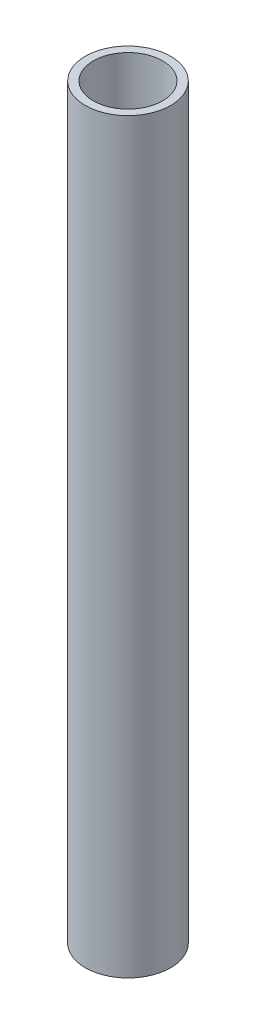
ISO-10303-21;
HEADER;
FILE_DESCRIPTION(('STEP AP214'),'2;1');
FILE_NAME('part.step','',(''),(''),'','','');
FILE_SCHEMA(('AUTOMOTIVE_DESIGN { 1 0 10303 214 1 1 1 1 }'));
ENDSEC;
DATA;
#1=APPLICATION_CONTEXT('core data for automotive mechanical design processes');
#2=APPLICATION_PROTOCOL_DEFINITION('international standard','automotive_design',2000,#1);
#3=PRODUCT_CONTEXT('',#1,'mechanical');
#4=PRODUCT('Part','Part','',(#3));
#5=PRODUCT_RELATED_PRODUCT_CATEGORY('part','',(#4));
#6=PRODUCT_DEFINITION_FORMATION('','',#4);
#7=PRODUCT_DEFINITION_CONTEXT('part definition',#1,'design');
#8=PRODUCT_DEFINITION('design','',#6,#7);
#9=PRODUCT_DEFINITION_SHAPE('','',#8);
#10=(LENGTH_UNIT() NAMED_UNIT(*) SI_UNIT(.MILLI.,.METRE.));
#11=(NAMED_UNIT(*) PLANE_ANGLE_UNIT() SI_UNIT($,.RADIAN.));
#12=(NAMED_UNIT(*) SI_UNIT($,.STERADIAN.) SOLID_ANGLE_UNIT());
#13=UNCERTAINTY_MEASURE_WITH_UNIT(LENGTH_MEASURE(1.E-05),#10,'distance_accuracy_value','');
#14=(GEOMETRIC_REPRESENTATION_CONTEXT(3) GLOBAL_UNCERTAINTY_ASSIGNED_CONTEXT((#13)) GLOBAL_UNIT_ASSIGNED_CONTEXT((#10,
#11,#12)) REPRESENTATION_CONTEXT('',''));
#15=CARTESIAN_POINT('',(0.,0.,0.));
#16=DIRECTION('',(0.,0.,1.));
#17=DIRECTION('',(1.,0.,0.));
#18=AXIS2_PLACEMENT_3D('',#15,#16,#17);
#19=CARTESIAN_POINT('',(0.,140.,0.));
#20=DIRECTION('',(0.,1.,0.));
#21=DIRECTION('',(0.,0.,1.));
#22=AXIS2_PLACEMENT_3D('',#19,#20,#21);
#23=PLANE('',#22);
#24=CARTESIAN_POINT('',(0.,140.,0.));
#25=DIRECTION('',(0.,1.,0.));
#26=DIRECTION('',(0.,0.,1.));
#27=AXIS2_PLACEMENT_3D('',#24,#25,#26);
#28=CIRCLE('',#27,8.);
#29=CARTESIAN_POINT('',(0.,140.,8.));
#30=VERTEX_POINT('',#29);
#31=EDGE_CURVE('E10',#30,#30,#28,.T.);
#32=ORIENTED_EDGE('',*,*,#31,.T.);
#33=EDGE_LOOP('',(#32));
#34=FACE_BOUND('',#33,.T.);
#35=CARTESIAN_POINT('',(0.,140.,0.));
#36=DIRECTION('',(0.,1.,0.));
#37=DIRECTION('',(0.,0.,1.));
#38=AXIS2_PLACEMENT_3D('',#35,#36,#37);
#39=CIRCLE('',#38,6.5);
#40=CARTESIAN_POINT('',(0.,140.,6.5));
#41=VERTEX_POINT('',#40);
#42=EDGE_CURVE('E44',#41,#41,#39,.T.);
#43=ORIENTED_EDGE('',*,*,#42,.F.);
#44=EDGE_LOOP('',(#43));
#45=FACE_BOUND('',#44,.T.);
#46=ADVANCED_FACE('F33',(#34,#45),#23,.T.);
#47=CARTESIAN_POINT('',(0.,0.,0.));
#48=DIRECTION('',(0.,1.,0.));
#49=DIRECTION('',(0.,0.,1.));
#50=AXIS2_PLACEMENT_3D('',#47,#48,#49);
#51=PLANE('',#50);
#52=CARTESIAN_POINT('',(0.,0.,0.));
#53=DIRECTION('',(0.,1.,0.));
#54=DIRECTION('',(0.,0.,1.));
#55=AXIS2_PLACEMENT_3D('',#52,#53,#54);
#56=CIRCLE('',#55,8.);
#57=CARTESIAN_POINT('',(0.,0.,8.));
#58=VERTEX_POINT('',#57);
#59=EDGE_CURVE('E37',#58,#58,#56,.T.);
#60=ORIENTED_EDGE('',*,*,#59,.F.);
#61=EDGE_LOOP('',(#60));
#62=FACE_BOUND('',#61,.T.);
#63=CARTESIAN_POINT('',(0.,0.,0.));
#64=DIRECTION('',(0.,1.,0.));
#65=DIRECTION('',(0.,0.,1.));
#66=AXIS2_PLACEMENT_3D('',#63,#64,#65);
#67=CIRCLE('',#66,6.5);
#68=CARTESIAN_POINT('',(0.,0.,6.5));
#69=VERTEX_POINT('',#68);
#70=EDGE_CURVE('E46',#69,#69,#67,.T.);
#71=ORIENTED_EDGE('',*,*,#70,.T.);
#72=EDGE_LOOP('',(#71));
#73=FACE_BOUND('',#72,.T.);
#74=ADVANCED_FACE('F56',(#62,#73),#51,.F.);
#75=CARTESIAN_POINT('',(0.,140.,0.));
#76=DIRECTION('',(0.,-1.,0.));
#77=DIRECTION('',(0.,0.,-1.));
#78=AXIS2_PLACEMENT_3D('',#75,#76,#77);
#79=CYLINDRICAL_SURFACE('',#78,8.);
#80=ORIENTED_EDGE('',*,*,#31,.F.);
#81=EDGE_LOOP('',(#80));
#82=FACE_BOUND('',#81,.T.);
#83=ORIENTED_EDGE('',*,*,#59,.T.);
#84=EDGE_LOOP('',(#83));
#85=FACE_BOUND('',#84,.T.);
#86=ADVANCED_FACE('F35',(#82,#85),#79,.T.);
#87=CARTESIAN_POINT('',(0.,140.,0.));
#88=DIRECTION('',(0.,-1.,0.));
#89=DIRECTION('',(0.,0.,-1.));
#90=AXIS2_PLACEMENT_3D('',#87,#88,#89);
#91=CYLINDRICAL_SURFACE('',#90,6.5);
#92=ORIENTED_EDGE('',*,*,#42,.T.);
#93=EDGE_LOOP('',(#92));
#94=FACE_BOUND('',#93,.T.);
#95=ORIENTED_EDGE('',*,*,#70,.F.);
#96=EDGE_LOOP('',(#95));
#97=FACE_BOUND('',#96,.T.);
#98=ADVANCED_FACE('F52',(#94,#97),#91,.F.);
#99=CLOSED_SHELL('',(#46,#74,#86,#98));
#100=MANIFOLD_SOLID_BREP('B2',#99);
#101=ADVANCED_BREP_SHAPE_REPRESENTATION('',(#18,#100),#14);
#102=SHAPE_DEFINITION_REPRESENTATION(#9,#101);
ENDSEC;
END-ISO-10303-21;
